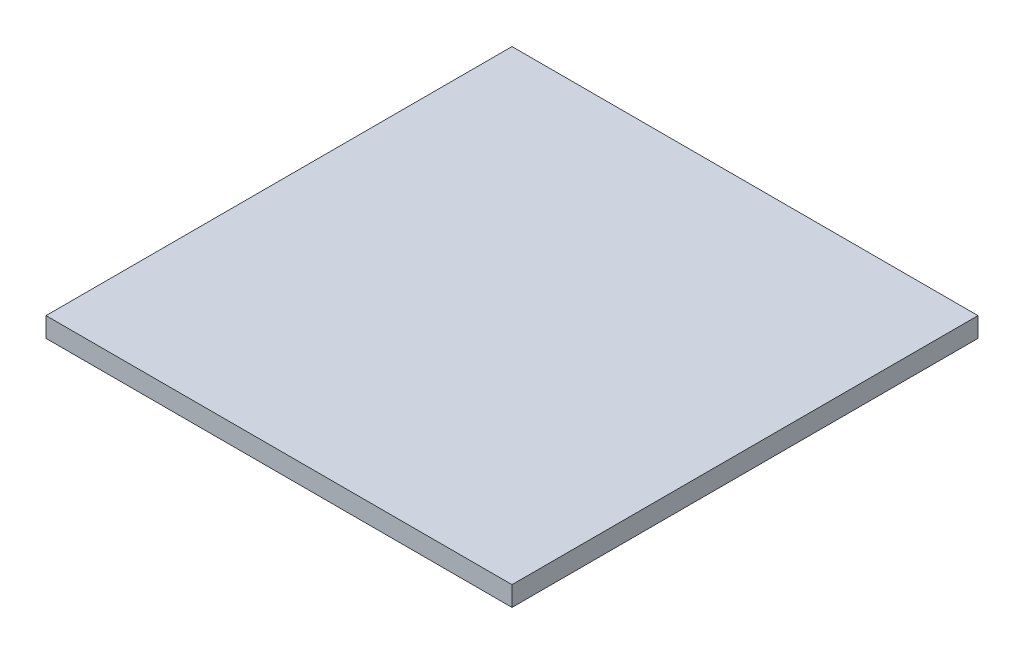
ISO-10303-21;
HEADER;
FILE_DESCRIPTION(('STEP AP214'),'2;1');
FILE_NAME('part.step','',(''),(''),'','','');
FILE_SCHEMA(('AUTOMOTIVE_DESIGN { 1 0 10303 214 1 1 1 1 }'));
ENDSEC;
DATA;
#1=APPLICATION_CONTEXT('core data for automotive mechanical design processes');
#2=APPLICATION_PROTOCOL_DEFINITION('international standard','automotive_design',2000,#1);
#3=PRODUCT_CONTEXT('',#1,'mechanical');
#4=PRODUCT('Part','Part','',(#3));
#5=PRODUCT_RELATED_PRODUCT_CATEGORY('part','',(#4));
#6=PRODUCT_DEFINITION_FORMATION('','',#4);
#7=PRODUCT_DEFINITION_CONTEXT('part definition',#1,'design');
#8=PRODUCT_DEFINITION('design','',#6,#7);
#9=PRODUCT_DEFINITION_SHAPE('','',#8);
#10=(LENGTH_UNIT() NAMED_UNIT(*) SI_UNIT(.MILLI.,.METRE.));
#11=(NAMED_UNIT(*) PLANE_ANGLE_UNIT() SI_UNIT($,.RADIAN.));
#12=(NAMED_UNIT(*) SI_UNIT($,.STERADIAN.) SOLID_ANGLE_UNIT());
#13=UNCERTAINTY_MEASURE_WITH_UNIT(LENGTH_MEASURE(1.E-05),#10,'distance_accuracy_value','');
#14=(GEOMETRIC_REPRESENTATION_CONTEXT(3) GLOBAL_UNCERTAINTY_ASSIGNED_CONTEXT((#13)) GLOBAL_UNIT_ASSIGNED_CONTEXT((#10,
#11,#12)) REPRESENTATION_CONTEXT('',''));
#15=CARTESIAN_POINT('',(0.,0.,0.));
#16=DIRECTION('',(0.,0.,1.));
#17=DIRECTION('',(1.,0.,0.));
#18=AXIS2_PLACEMENT_3D('',#15,#16,#17);
#19=CARTESIAN_POINT('',(149.85,12.7,-149.85));
#20=DIRECTION('',(-1.,0.,0.));
#21=DIRECTION('',(0.,0.,1.));
#22=AXIS2_PLACEMENT_3D('',#19,#20,#21);
#23=PLANE('',#22);
#24=DIRECTION('',(0.,0.,-1.));
#25=VECTOR('',#24,1.);
#26=CARTESIAN_POINT('',(149.85,0.,-149.85));
#27=LINE('',#26,#25);
#28=CARTESIAN_POINT('',(149.85,0.,149.85));
#29=VERTEX_POINT('',#28);
#30=CARTESIAN_POINT('',(149.85,0.,-149.85));
#31=VERTEX_POINT('',#30);
#32=EDGE_CURVE('E96',#29,#31,#27,.T.);
#33=ORIENTED_EDGE('',*,*,#32,.T.);
#34=DIRECTION('',(0.,-1.,0.));
#35=VECTOR('',#34,1.);
#36=CARTESIAN_POINT('',(149.85,12.7,-149.85));
#37=LINE('',#36,#35);
#38=CARTESIAN_POINT('',(149.85,12.7,-149.85));
#39=VERTEX_POINT('',#38);
#40=EDGE_CURVE('E11',#39,#31,#37,.T.);
#41=ORIENTED_EDGE('',*,*,#40,.F.);
#42=DIRECTION('',(0.,0.,-1.));
#43=VECTOR('',#42,1.);
#44=CARTESIAN_POINT('',(149.85,12.7,-149.85));
#45=LINE('',#44,#43);
#46=CARTESIAN_POINT('',(149.85,12.7,149.85));
#47=VERTEX_POINT('',#46);
#48=EDGE_CURVE('E84',#47,#39,#45,.T.);
#49=ORIENTED_EDGE('',*,*,#48,.F.);
#50=DIRECTION('',(0.,-1.,0.));
#51=VECTOR('',#50,1.);
#52=CARTESIAN_POINT('',(149.85,12.7,149.85));
#53=LINE('',#52,#51);
#54=EDGE_CURVE('E92',#47,#29,#53,.T.);
#55=ORIENTED_EDGE('',*,*,#54,.T.);
#56=EDGE_LOOP('',(#33,#41,#49,#55));
#57=FACE_BOUND('',#56,.T.);
#58=ADVANCED_FACE('F33',(#57),#23,.F.);
#59=CARTESIAN_POINT('',(-149.85,12.7,-149.85));
#60=DIRECTION('',(0.,0.,1.));
#61=DIRECTION('',(1.,0.,0.));
#62=AXIS2_PLACEMENT_3D('',#59,#60,#61);
#63=PLANE('',#62);
#64=DIRECTION('',(-1.,0.,0.));
#65=VECTOR('',#64,1.);
#66=CARTESIAN_POINT('',(-149.85,0.,-149.85));
#67=LINE('',#66,#65);
#68=CARTESIAN_POINT('',(-149.85,0.,-149.85));
#69=VERTEX_POINT('',#68);
#70=EDGE_CURVE('E88',#31,#69,#67,.T.);
#71=ORIENTED_EDGE('',*,*,#70,.T.);
#72=DIRECTION('',(0.,-1.,0.));
#73=VECTOR('',#72,1.);
#74=CARTESIAN_POINT('',(-149.85,12.7,-149.85));
#75=LINE('',#74,#73);
#76=CARTESIAN_POINT('',(-149.85,12.7,-149.85));
#77=VERTEX_POINT('',#76);
#78=EDGE_CURVE('E41',#77,#69,#75,.T.);
#79=ORIENTED_EDGE('',*,*,#78,.F.);
#80=DIRECTION('',(-1.,0.,0.));
#81=VECTOR('',#80,1.);
#82=CARTESIAN_POINT('',(-149.85,12.7,-149.85));
#83=LINE('',#82,#81);
#84=EDGE_CURVE('E79',#39,#77,#83,.T.);
#85=ORIENTED_EDGE('',*,*,#84,.F.);
#86=ORIENTED_EDGE('',*,*,#40,.T.);
#87=EDGE_LOOP('',(#71,#79,#85,#86));
#88=FACE_BOUND('',#87,.T.);
#89=ADVANCED_FACE('F87',(#88),#63,.F.);
#90=CARTESIAN_POINT('',(-149.85,12.7,-149.85));
#91=DIRECTION('',(1.,0.,0.));
#92=DIRECTION('',(0.,0.,-1.));
#93=AXIS2_PLACEMENT_3D('',#90,#91,#92);
#94=PLANE('',#93);
#95=DIRECTION('',(0.,0.,1.));
#96=VECTOR('',#95,1.);
#97=CARTESIAN_POINT('',(-149.85,0.,-149.85));
#98=LINE('',#97,#96);
#99=CARTESIAN_POINT('',(-149.85,0.,149.85));
#100=VERTEX_POINT('',#99);
#101=EDGE_CURVE('E66',#69,#100,#98,.T.);
#102=ORIENTED_EDGE('',*,*,#101,.T.);
#103=DIRECTION('',(0.,-1.,0.));
#104=VECTOR('',#103,1.);
#105=CARTESIAN_POINT('',(-149.85,12.7,149.85));
#106=LINE('',#105,#104);
#107=CARTESIAN_POINT('',(-149.85,12.7,149.85));
#108=VERTEX_POINT('',#107);
#109=EDGE_CURVE('E89',#108,#100,#106,.T.);
#110=ORIENTED_EDGE('',*,*,#109,.F.);
#111=DIRECTION('',(0.,0.,1.));
#112=VECTOR('',#111,1.);
#113=CARTESIAN_POINT('',(-149.85,12.7,-149.85));
#114=LINE('',#113,#112);
#115=EDGE_CURVE('E82',#77,#108,#114,.T.);
#116=ORIENTED_EDGE('',*,*,#115,.F.);
#117=ORIENTED_EDGE('',*,*,#78,.T.);
#118=EDGE_LOOP('',(#102,#110,#116,#117));
#119=FACE_BOUND('',#118,.T.);
#120=ADVANCED_FACE('F90',(#119),#94,.F.);
#121=CARTESIAN_POINT('',(-149.85,12.7,149.85));
#122=DIRECTION('',(0.,0.,-1.));
#123=DIRECTION('',(-1.,0.,0.));
#124=AXIS2_PLACEMENT_3D('',#121,#122,#123);
#125=PLANE('',#124);
#126=DIRECTION('',(1.,0.,0.));
#127=VECTOR('',#126,1.);
#128=CARTESIAN_POINT('',(-149.85,0.,149.85));
#129=LINE('',#128,#127);
#130=EDGE_CURVE('E72',#100,#29,#129,.T.);
#131=ORIENTED_EDGE('',*,*,#130,.T.);
#132=ORIENTED_EDGE('',*,*,#54,.F.);
#133=DIRECTION('',(1.,0.,0.));
#134=VECTOR('',#133,1.);
#135=CARTESIAN_POINT('',(-149.85,12.7,149.85));
#136=LINE('',#135,#134);
#137=EDGE_CURVE('E49',#108,#47,#136,.T.);
#138=ORIENTED_EDGE('',*,*,#137,.F.);
#139=ORIENTED_EDGE('',*,*,#109,.T.);
#140=EDGE_LOOP('',(#131,#132,#138,#139));
#141=FACE_BOUND('',#140,.T.);
#142=ADVANCED_FACE('F103',(#141),#125,.F.);
#143=CARTESIAN_POINT('',(0.,12.7,0.));
#144=DIRECTION('',(0.,1.,0.));
#145=DIRECTION('',(0.,0.,1.));
#146=AXIS2_PLACEMENT_3D('',#143,#144,#145);
#147=PLANE('',#146);
#148=ORIENTED_EDGE('',*,*,#48,.T.);
#149=ORIENTED_EDGE('',*,*,#84,.T.);
#150=ORIENTED_EDGE('',*,*,#115,.T.);
#151=ORIENTED_EDGE('',*,*,#137,.T.);
#152=EDGE_LOOP('',(#148,#149,#150,#151));
#153=FACE_BOUND('',#152,.T.);
#154=ADVANCED_FACE('F80',(#153),#147,.T.);
#155=CARTESIAN_POINT('',(0.,0.,0.));
#156=DIRECTION('',(0.,1.,0.));
#157=DIRECTION('',(0.,0.,1.));
#158=AXIS2_PLACEMENT_3D('',#155,#156,#157);
#159=PLANE('',#158);
#160=ORIENTED_EDGE('',*,*,#32,.F.);
#161=ORIENTED_EDGE('',*,*,#130,.F.);
#162=ORIENTED_EDGE('',*,*,#101,.F.);
#163=ORIENTED_EDGE('',*,*,#70,.F.);
#164=EDGE_LOOP('',(#160,#161,#162,#163));
#165=FACE_BOUND('',#164,.T.);
#166=ADVANCED_FACE('F106',(#165),#159,.F.);
#167=CLOSED_SHELL('',(#58,#89,#120,#142,#154,#166));
#168=MANIFOLD_SOLID_BREP('B2',#167);
#169=ADVANCED_BREP_SHAPE_REPRESENTATION('',(#18,#168),#14);
#170=SHAPE_DEFINITION_REPRESENTATION(#9,#169);
ENDSEC;
END-ISO-10303-21;
